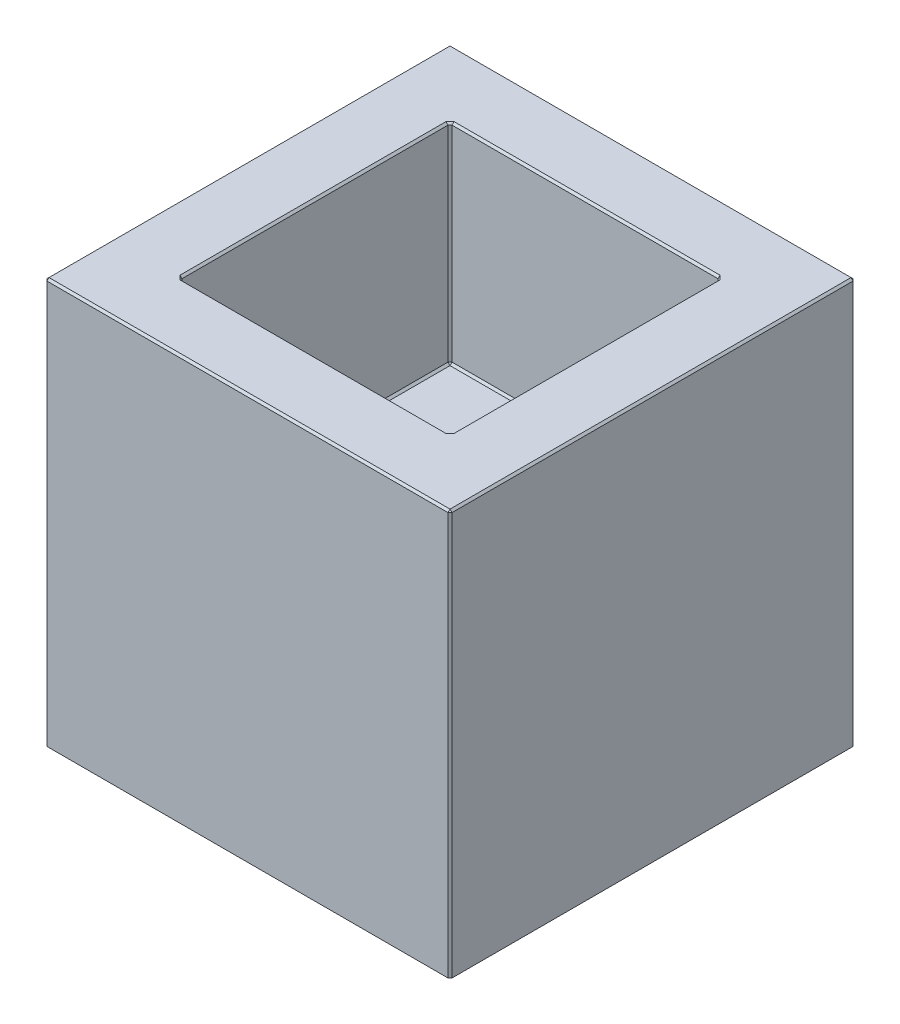
ISO-10303-21;
HEADER;
FILE_DESCRIPTION(('STEP AP214'),'2;1');
FILE_NAME('part.step','',(''),(''),'','','');
FILE_SCHEMA(('AUTOMOTIVE_DESIGN { 1 0 10303 214 1 1 1 1 }'));
ENDSEC;
DATA;
#1=APPLICATION_CONTEXT('core data for automotive mechanical design processes');
#2=APPLICATION_PROTOCOL_DEFINITION('international standard','automotive_design',2000,#1);
#3=PRODUCT_CONTEXT('',#1,'mechanical');
#4=PRODUCT('Part','Part','',(#3));
#5=PRODUCT_RELATED_PRODUCT_CATEGORY('part','',(#4));
#6=PRODUCT_DEFINITION_FORMATION('','',#4);
#7=PRODUCT_DEFINITION_CONTEXT('part definition',#1,'design');
#8=PRODUCT_DEFINITION('design','',#6,#7);
#9=PRODUCT_DEFINITION_SHAPE('','',#8);
#10=(LENGTH_UNIT() NAMED_UNIT(*) SI_UNIT(.MILLI.,.METRE.));
#11=(NAMED_UNIT(*) PLANE_ANGLE_UNIT() SI_UNIT($,.RADIAN.));
#12=(NAMED_UNIT(*) SI_UNIT($,.STERADIAN.) SOLID_ANGLE_UNIT());
#13=UNCERTAINTY_MEASURE_WITH_UNIT(LENGTH_MEASURE(1.E-05),#10,'distance_accuracy_value','');
#14=(GEOMETRIC_REPRESENTATION_CONTEXT(3) GLOBAL_UNCERTAINTY_ASSIGNED_CONTEXT((#13)) GLOBAL_UNIT_ASSIGNED_CONTEXT((#10,
#11,#12)) REPRESENTATION_CONTEXT('',''));
#15=CARTESIAN_POINT('',(0.,0.,0.));
#16=DIRECTION('',(0.,0.,1.));
#17=DIRECTION('',(1.,0.,0.));
#18=AXIS2_PLACEMENT_3D('',#15,#16,#17);
#19=CARTESIAN_POINT('',(0.,6.,0.));
#20=DIRECTION('',(0.,-1.,0.));
#21=DIRECTION('',(0.,0.,-1.));
#22=AXIS2_PLACEMENT_3D('',#19,#20,#21);
#23=PLANE('',#22);
#24=DIRECTION('',(0.,0.,1.));
#25=VECTOR('',#24,1.);
#26=CARTESIAN_POINT('',(-2.97,6.,0.));
#27=LINE('',#26,#25);
#28=CARTESIAN_POINT('',(-2.97,6.,-2.97));
#29=VERTEX_POINT('',#28);
#30=CARTESIAN_POINT('',(-2.97,6.,2.97));
#31=VERTEX_POINT('',#30);
#32=EDGE_CURVE('E244',#29,#31,#27,.T.);
#33=ORIENTED_EDGE('',*,*,#32,.T.);
#34=DIRECTION('',(1.,0.,0.));
#35=VECTOR('',#34,1.);
#36=CARTESIAN_POINT('',(0.,6.,2.97));
#37=LINE('',#36,#35);
#38=CARTESIAN_POINT('',(2.97,6.,2.97));
#39=VERTEX_POINT('',#38);
#40=EDGE_CURVE('E246',#31,#39,#37,.T.);
#41=ORIENTED_EDGE('',*,*,#40,.T.);
#42=DIRECTION('',(0.,0.,-1.));
#43=VECTOR('',#42,1.);
#44=CARTESIAN_POINT('',(2.97,6.,0.));
#45=LINE('',#44,#43);
#46=CARTESIAN_POINT('',(2.97,6.,-2.97));
#47=VERTEX_POINT('',#46);
#48=EDGE_CURVE('E240',#39,#47,#45,.T.);
#49=ORIENTED_EDGE('',*,*,#48,.T.);
#50=DIRECTION('',(-1.,0.,0.));
#51=VECTOR('',#50,1.);
#52=CARTESIAN_POINT('',(0.,6.,-2.97));
#53=LINE('',#52,#51);
#54=EDGE_CURVE('E242',#47,#29,#53,.T.);
#55=ORIENTED_EDGE('',*,*,#54,.T.);
#56=EDGE_LOOP('',(#33,#41,#49,#55));
#57=FACE_BOUND('',#56,.T.);
#58=DIRECTION('',(0.707106781186548,0.,0.707106781186548));
#59=VECTOR('',#58,1.);
#60=CARTESIAN_POINT('',(-1.97,6.,2.03));
#61=LINE('',#60,#59);
#62=CARTESIAN_POINT('',(-2.03,6.,1.97));
#63=VERTEX_POINT('',#62);
#64=CARTESIAN_POINT('',(-2.,6.,2.));
#65=VERTEX_POINT('',#64);
#66=EDGE_CURVE('E221',#63,#65,#61,.T.);
#67=ORIENTED_EDGE('',*,*,#66,.F.);
#68=DIRECTION('',(0.,0.,-1.));
#69=VECTOR('',#68,1.);
#70=CARTESIAN_POINT('',(-2.03,6.,0.));
#71=LINE('',#70,#69);
#72=CARTESIAN_POINT('',(-2.03,6.,-1.97));
#73=VERTEX_POINT('',#72);
#74=EDGE_CURVE('E217',#63,#73,#71,.T.);
#75=ORIENTED_EDGE('',*,*,#74,.T.);
#76=DIRECTION('',(-0.707106781186532,0.,0.707106781186563));
#77=VECTOR('',#76,1.);
#78=CARTESIAN_POINT('',(-2.03,6.,-1.97));
#79=LINE('',#78,#77);
#80=CARTESIAN_POINT('',(-2.,6.,-2.));
#81=VERTEX_POINT('',#80);
#82=EDGE_CURVE('E212',#81,#73,#79,.T.);
#83=ORIENTED_EDGE('',*,*,#82,.F.);
#84=DIRECTION('',(-0.707106781186532,0.,0.707106781186563));
#85=VECTOR('',#84,1.);
#86=CARTESIAN_POINT('',(-2.03,6.,-1.97));
#87=LINE('',#86,#85);
#88=CARTESIAN_POINT('',(-1.97,6.,-2.03));
#89=VERTEX_POINT('',#88);
#90=EDGE_CURVE('E214',#89,#81,#87,.T.);
#91=ORIENTED_EDGE('',*,*,#90,.F.);
#92=DIRECTION('',(1.,0.,0.));
#93=VECTOR('',#92,1.);
#94=CARTESIAN_POINT('',(0.,6.,-2.03));
#95=LINE('',#94,#93);
#96=CARTESIAN_POINT('',(1.97,6.,-2.03));
#97=VERTEX_POINT('',#96);
#98=EDGE_CURVE('E229',#89,#97,#95,.T.);
#99=ORIENTED_EDGE('',*,*,#98,.T.);
#100=DIRECTION('',(-0.707106781186548,0.,-0.707106781186548));
#101=VECTOR('',#100,1.);
#102=CARTESIAN_POINT('',(1.97,6.,-2.03));
#103=LINE('',#102,#101);
#104=CARTESIAN_POINT('',(2.,6.,-2.));
#105=VERTEX_POINT('',#104);
#106=EDGE_CURVE('E233',#105,#97,#103,.T.);
#107=ORIENTED_EDGE('',*,*,#106,.F.);
#108=DIRECTION('',(-0.707106781186548,0.,-0.707106781186548));
#109=VECTOR('',#108,1.);
#110=CARTESIAN_POINT('',(1.97,6.,-2.03));
#111=LINE('',#110,#109);
#112=CARTESIAN_POINT('',(2.03,6.,-1.97));
#113=VERTEX_POINT('',#112);
#114=EDGE_CURVE('E436',#113,#105,#111,.T.);
#115=ORIENTED_EDGE('',*,*,#114,.F.);
#116=DIRECTION('',(0.,0.,1.));
#117=VECTOR('',#116,1.);
#118=CARTESIAN_POINT('',(2.03,6.,0.));
#119=LINE('',#118,#117);
#120=CARTESIAN_POINT('',(2.03,6.,1.97));
#121=VERTEX_POINT('',#120);
#122=EDGE_CURVE('E442',#113,#121,#119,.T.);
#123=ORIENTED_EDGE('',*,*,#122,.T.);
#124=DIRECTION('',(0.707106781186563,0.,-0.707106781186532));
#125=VECTOR('',#124,1.);
#126=CARTESIAN_POINT('',(2.03,6.,1.97));
#127=LINE('',#126,#125);
#128=CARTESIAN_POINT('',(2.,6.,2.));
#129=VERTEX_POINT('',#128);
#130=EDGE_CURVE('E451',#129,#121,#127,.T.);
#131=ORIENTED_EDGE('',*,*,#130,.F.);
#132=DIRECTION('',(0.707106781186563,0.,-0.707106781186532));
#133=VECTOR('',#132,1.);
#134=CARTESIAN_POINT('',(2.03,6.,1.97));
#135=LINE('',#134,#133);
#136=CARTESIAN_POINT('',(1.97,6.,2.03));
#137=VERTEX_POINT('',#136);
#138=EDGE_CURVE('E446',#137,#129,#135,.T.);
#139=ORIENTED_EDGE('',*,*,#138,.F.);
#140=DIRECTION('',(-1.,0.,0.));
#141=VECTOR('',#140,1.);
#142=CARTESIAN_POINT('',(0.,6.,2.03));
#143=LINE('',#142,#141);
#144=CARTESIAN_POINT('',(-1.97,6.,2.03));
#145=VERTEX_POINT('',#144);
#146=EDGE_CURVE('E439',#137,#145,#143,.T.);
#147=ORIENTED_EDGE('',*,*,#146,.T.);
#148=DIRECTION('',(0.707106781186548,0.,0.707106781186548));
#149=VECTOR('',#148,1.);
#150=CARTESIAN_POINT('',(-1.97,6.,2.03));
#151=LINE('',#150,#149);
#152=EDGE_CURVE('E228',#65,#145,#151,.T.);
#153=ORIENTED_EDGE('',*,*,#152,.F.);
#154=EDGE_LOOP('',(#67,#75,#83,#91,#99,#107,#115,#123,#131,#139,#147,#153));
#155=FACE_BOUND('',#154,.T.);
#156=ADVANCED_FACE('F39',(#57,#155),#23,.F.);
#157=CARTESIAN_POINT('',(3.,6.,3.));
#158=DIRECTION('',(-1.,0.,0.));
#159=DIRECTION('',(0.,0.,1.));
#160=AXIS2_PLACEMENT_3D('',#157,#158,#159);
#161=PLANE('',#160);
#162=DIRECTION('',(0.,0.,-1.));
#163=VECTOR('',#162,1.);
#164=CARTESIAN_POINT('',(3.,0.,3.));
#165=LINE('',#164,#163);
#166=CARTESIAN_POINT('',(3.,0.,2.97));
#167=VERTEX_POINT('',#166);
#168=CARTESIAN_POINT('',(3.,0.,-2.97));
#169=VERTEX_POINT('',#168);
#170=EDGE_CURVE('E325',#167,#169,#165,.T.);
#171=ORIENTED_EDGE('',*,*,#170,.T.);
#172=DIRECTION('',(0.,1.,0.));
#173=VECTOR('',#172,1.);
#174=CARTESIAN_POINT('',(3.,6.,-2.97));
#175=LINE('',#174,#173);
#176=CARTESIAN_POINT('',(3.,5.97,-2.97));
#177=VERTEX_POINT('',#176);
#178=EDGE_CURVE('E466',#169,#177,#175,.T.);
#179=ORIENTED_EDGE('',*,*,#178,.T.);
#180=DIRECTION('',(0.,0.,1.));
#181=VECTOR('',#180,1.);
#182=CARTESIAN_POINT('',(3.,5.97,3.));
#183=LINE('',#182,#181);
#184=CARTESIAN_POINT('',(3.,5.97,2.97));
#185=VERTEX_POINT('',#184);
#186=EDGE_CURVE('E470',#177,#185,#183,.T.);
#187=ORIENTED_EDGE('',*,*,#186,.T.);
#188=DIRECTION('',(0.,-1.,0.));
#189=VECTOR('',#188,1.);
#190=CARTESIAN_POINT('',(3.,6.,2.97));
#191=LINE('',#190,#189);
#192=EDGE_CURVE('E468',#185,#167,#191,.T.);
#193=ORIENTED_EDGE('',*,*,#192,.T.);
#194=EDGE_LOOP('',(#171,#179,#187,#193));
#195=FACE_BOUND('',#194,.T.);
#196=ADVANCED_FACE('F500',(#195),#161,.F.);
#197=CARTESIAN_POINT('',(-3.,6.,-3.));
#198=DIRECTION('',(0.,0.,1.));
#199=DIRECTION('',(1.,0.,0.));
#200=AXIS2_PLACEMENT_3D('',#197,#198,#199);
#201=PLANE('',#200);
#202=DIRECTION('',(1.,0.,0.));
#203=VECTOR('',#202,1.);
#204=CARTESIAN_POINT('',(-3.,5.97,-3.));
#205=LINE('',#204,#203);
#206=CARTESIAN_POINT('',(-2.97,5.97,-3.));
#207=VERTEX_POINT('',#206);
#208=CARTESIAN_POINT('',(2.97,5.97,-3.));
#209=VERTEX_POINT('',#208);
#210=EDGE_CURVE('E485',#207,#209,#205,.T.);
#211=ORIENTED_EDGE('',*,*,#210,.T.);
#212=DIRECTION('',(0.,-1.,0.));
#213=VECTOR('',#212,1.);
#214=CARTESIAN_POINT('',(2.97,6.,-3.));
#215=LINE('',#214,#213);
#216=CARTESIAN_POINT('',(2.97,0.,-3.));
#217=VERTEX_POINT('',#216);
#218=EDGE_CURVE('E480',#209,#217,#215,.T.);
#219=ORIENTED_EDGE('',*,*,#218,.T.);
#220=DIRECTION('',(-1.,0.,0.));
#221=VECTOR('',#220,1.);
#222=CARTESIAN_POINT('',(-3.,0.,-3.));
#223=LINE('',#222,#221);
#224=CARTESIAN_POINT('',(-2.97,0.,-3.));
#225=VERTEX_POINT('',#224);
#226=EDGE_CURVE('E493',#217,#225,#223,.T.);
#227=ORIENTED_EDGE('',*,*,#226,.T.);
#228=DIRECTION('',(0.,1.,0.));
#229=VECTOR('',#228,1.);
#230=CARTESIAN_POINT('',(-2.97,6.,-3.));
#231=LINE('',#230,#229);
#232=EDGE_CURVE('E483',#225,#207,#231,.T.);
#233=ORIENTED_EDGE('',*,*,#232,.T.);
#234=EDGE_LOOP('',(#211,#219,#227,#233));
#235=FACE_BOUND('',#234,.T.);
#236=ADVANCED_FACE('F565',(#235),#201,.F.);
#237=CARTESIAN_POINT('',(-3.,6.,3.));
#238=DIRECTION('',(1.,0.,0.));
#239=DIRECTION('',(0.,0.,-1.));
#240=AXIS2_PLACEMENT_3D('',#237,#238,#239);
#241=PLANE('',#240);
#242=DIRECTION('',(0.,0.,-1.));
#243=VECTOR('',#242,1.);
#244=CARTESIAN_POINT('',(-3.,5.97,3.));
#245=LINE('',#244,#243);
#246=CARTESIAN_POINT('',(-3.,5.97,2.97));
#247=VERTEX_POINT('',#246);
#248=CARTESIAN_POINT('',(-3.,5.97,-2.97));
#249=VERTEX_POINT('',#248);
#250=EDGE_CURVE('E464',#247,#249,#245,.T.);
#251=ORIENTED_EDGE('',*,*,#250,.T.);
#252=DIRECTION('',(0.,-1.,0.));
#253=VECTOR('',#252,1.);
#254=CARTESIAN_POINT('',(-3.,6.,-2.97));
#255=LINE('',#254,#253);
#256=CARTESIAN_POINT('',(-3.,0.,-2.97));
#257=VERTEX_POINT('',#256);
#258=EDGE_CURVE('E460',#249,#257,#255,.T.);
#259=ORIENTED_EDGE('',*,*,#258,.T.);
#260=DIRECTION('',(0.,0.,1.));
#261=VECTOR('',#260,1.);
#262=CARTESIAN_POINT('',(-3.,0.,3.));
#263=LINE('',#262,#261);
#264=CARTESIAN_POINT('',(-3.,0.,2.97));
#265=VERTEX_POINT('',#264);
#266=EDGE_CURVE('E490',#257,#265,#263,.T.);
#267=ORIENTED_EDGE('',*,*,#266,.T.);
#268=DIRECTION('',(0.,1.,0.));
#269=VECTOR('',#268,1.);
#270=CARTESIAN_POINT('',(-3.,6.,2.97));
#271=LINE('',#270,#269);
#272=EDGE_CURVE('E462',#265,#247,#271,.T.);
#273=ORIENTED_EDGE('',*,*,#272,.T.);
#274=EDGE_LOOP('',(#251,#259,#267,#273));
#275=FACE_BOUND('',#274,.T.);
#276=ADVANCED_FACE('F552',(#275),#241,.F.);
#277=CARTESIAN_POINT('',(-3.,6.,3.));
#278=DIRECTION('',(0.,0.,-1.));
#279=DIRECTION('',(-1.,0.,0.));
#280=AXIS2_PLACEMENT_3D('',#277,#278,#279);
#281=PLANE('',#280);
#282=DIRECTION('',(-1.,0.,0.));
#283=VECTOR('',#282,1.);
#284=CARTESIAN_POINT('',(-3.,5.97,3.));
#285=LINE('',#284,#283);
#286=CARTESIAN_POINT('',(2.97,5.97,3.));
#287=VERTEX_POINT('',#286);
#288=CARTESIAN_POINT('',(-2.97,5.97,3.));
#289=VERTEX_POINT('',#288);
#290=EDGE_CURVE('E458',#287,#289,#285,.T.);
#291=ORIENTED_EDGE('',*,*,#290,.T.);
#292=DIRECTION('',(0.,-1.,0.));
#293=VECTOR('',#292,1.);
#294=CARTESIAN_POINT('',(-2.97,6.,3.));
#295=LINE('',#294,#293);
#296=CARTESIAN_POINT('',(-2.97,0.,3.));
#297=VERTEX_POINT('',#296);
#298=EDGE_CURVE('E454',#289,#297,#295,.T.);
#299=ORIENTED_EDGE('',*,*,#298,.T.);
#300=DIRECTION('',(1.,0.,0.));
#301=VECTOR('',#300,1.);
#302=CARTESIAN_POINT('',(-3.,0.,3.));
#303=LINE('',#302,#301);
#304=CARTESIAN_POINT('',(2.97,0.,3.));
#305=VERTEX_POINT('',#304);
#306=EDGE_CURVE('E487',#297,#305,#303,.T.);
#307=ORIENTED_EDGE('',*,*,#306,.T.);
#308=DIRECTION('',(0.,1.,0.));
#309=VECTOR('',#308,1.);
#310=CARTESIAN_POINT('',(2.97,6.,3.));
#311=LINE('',#310,#309);
#312=EDGE_CURVE('E456',#305,#287,#311,.T.);
#313=ORIENTED_EDGE('',*,*,#312,.T.);
#314=EDGE_LOOP('',(#291,#299,#307,#313));
#315=FACE_BOUND('',#314,.T.);
#316=ADVANCED_FACE('F546',(#315),#281,.F.);
#317=CARTESIAN_POINT('',(0.,0.,0.));
#318=DIRECTION('',(0.,-1.,0.));
#319=DIRECTION('',(0.,0.,-1.));
#320=AXIS2_PLACEMENT_3D('',#317,#318,#319);
#321=PLANE('',#320);
#322=ORIENTED_EDGE('',*,*,#226,.F.);
#323=DIRECTION('',(-0.707106781186537,0.,-0.707106781186558));
#324=VECTOR('',#323,1.);
#325=CARTESIAN_POINT('',(2.98500000000004,0.,-2.98499999999996));
#326=LINE('',#325,#324);
#327=EDGE_CURVE('E472',#217,#169,#326,.F.);
#328=ORIENTED_EDGE('',*,*,#327,.T.);
#329=ORIENTED_EDGE('',*,*,#170,.F.);
#330=DIRECTION('',(0.707106781186542,0.,-0.707106781186553));
#331=VECTOR('',#330,1.);
#332=CARTESIAN_POINT('',(2.98500000000002,0.,2.98499999999998));
#333=LINE('',#332,#331);
#334=EDGE_CURVE('E478',#167,#305,#333,.F.);
#335=ORIENTED_EDGE('',*,*,#334,.T.);
#336=ORIENTED_EDGE('',*,*,#306,.F.);
#337=DIRECTION('',(0.707106781186548,0.,0.707106781186548));
#338=VECTOR('',#337,1.);
#339=CARTESIAN_POINT('',(-2.985,0.,2.985));
#340=LINE('',#339,#338);
#341=EDGE_CURVE('E476',#297,#265,#340,.F.);
#342=ORIENTED_EDGE('',*,*,#341,.T.);
#343=ORIENTED_EDGE('',*,*,#266,.F.);
#344=DIRECTION('',(-0.707106781186542,0.,0.707106781186553));
#345=VECTOR('',#344,1.);
#346=CARTESIAN_POINT('',(-2.98500000000002,0.,-2.98499999999998));
#347=LINE('',#346,#345);
#348=EDGE_CURVE('E474',#257,#225,#347,.F.);
#349=ORIENTED_EDGE('',*,*,#348,.T.);
#350=EDGE_LOOP('',(#322,#328,#329,#335,#336,#342,#343,#349));
#351=FACE_BOUND('',#350,.T.);
#352=ADVANCED_FACE('F548',(#351),#321,.T.);
#353=CARTESIAN_POINT('',(2.,2.9,2.));
#354=DIRECTION('',(1.,0.,0.));
#355=DIRECTION('',(0.,0.,-1.));
#356=AXIS2_PLACEMENT_3D('',#353,#354,#355);
#357=PLANE('',#356);
#358=DIRECTION('',(0.,0.,1.));
#359=VECTOR('',#358,1.);
#360=CARTESIAN_POINT('',(2.,2.93,2.));
#361=LINE('',#360,#359);
#362=CARTESIAN_POINT('',(2.,2.93,-1.97));
#363=VERTEX_POINT('',#362);
#364=CARTESIAN_POINT('',(2.,2.93,1.97));
#365=VERTEX_POINT('',#364);
#366=EDGE_CURVE('E253',#363,#365,#361,.T.);
#367=ORIENTED_EDGE('',*,*,#366,.T.);
#368=DIRECTION('',(0.,1.,0.));
#369=VECTOR('',#368,1.);
#370=CARTESIAN_POINT('',(2.,6.,1.97));
#371=LINE('',#370,#369);
#372=CARTESIAN_POINT('',(2.,5.97,1.97));
#373=VERTEX_POINT('',#372);
#374=EDGE_CURVE('E255',#365,#373,#371,.T.);
#375=ORIENTED_EDGE('',*,*,#374,.T.);
#376=DIRECTION('',(0.,0.,-1.));
#377=VECTOR('',#376,1.);
#378=CARTESIAN_POINT('',(2.,5.97,2.));
#379=LINE('',#378,#377);
#380=CARTESIAN_POINT('',(2.,5.97,-1.97));
#381=VERTEX_POINT('',#380);
#382=EDGE_CURVE('E249',#373,#381,#379,.T.);
#383=ORIENTED_EDGE('',*,*,#382,.T.);
#384=DIRECTION('',(0.,-1.,0.));
#385=VECTOR('',#384,1.);
#386=CARTESIAN_POINT('',(2.,2.9,-1.97));
#387=LINE('',#386,#385);
#388=EDGE_CURVE('E251',#381,#363,#387,.T.);
#389=ORIENTED_EDGE('',*,*,#388,.T.);
#390=EDGE_LOOP('',(#367,#375,#383,#389));
#391=FACE_BOUND('',#390,.T.);
#392=ADVANCED_FACE('F420',(#391),#357,.F.);
#393=CARTESIAN_POINT('',(-2.,2.9,2.));
#394=DIRECTION('',(0.,0.,1.));
#395=DIRECTION('',(1.,0.,0.));
#396=AXIS2_PLACEMENT_3D('',#393,#394,#395);
#397=PLANE('',#396);
#398=DIRECTION('',(0.,-1.,0.));
#399=VECTOR('',#398,1.);
#400=CARTESIAN_POINT('',(1.97,2.9,2.));
#401=LINE('',#400,#399);
#402=CARTESIAN_POINT('',(1.97,5.97,2.));
#403=VERTEX_POINT('',#402);
#404=CARTESIAN_POINT('',(1.97,2.93,2.));
#405=VERTEX_POINT('',#404);
#406=EDGE_CURVE('E262',#403,#405,#401,.T.);
#407=ORIENTED_EDGE('',*,*,#406,.T.);
#408=DIRECTION('',(-1.,0.,0.));
#409=VECTOR('',#408,1.);
#410=CARTESIAN_POINT('',(-2.,2.93,2.));
#411=LINE('',#410,#409);
#412=CARTESIAN_POINT('',(-1.97,2.93,2.));
#413=VERTEX_POINT('',#412);
#414=EDGE_CURVE('E265',#405,#413,#411,.T.);
#415=ORIENTED_EDGE('',*,*,#414,.T.);
#416=DIRECTION('',(0.,1.,0.));
#417=VECTOR('',#416,1.);
#418=CARTESIAN_POINT('',(-1.97,6.,2.));
#419=LINE('',#418,#417);
#420=CARTESIAN_POINT('',(-1.97,5.97,2.));
#421=VERTEX_POINT('',#420);
#422=EDGE_CURVE('E260',#413,#421,#419,.T.);
#423=ORIENTED_EDGE('',*,*,#422,.T.);
#424=DIRECTION('',(1.,0.,0.));
#425=VECTOR('',#424,1.);
#426=CARTESIAN_POINT('',(-2.,5.97,2.));
#427=LINE('',#426,#425);
#428=EDGE_CURVE('E258',#421,#403,#427,.T.);
#429=ORIENTED_EDGE('',*,*,#428,.T.);
#430=EDGE_LOOP('',(#407,#415,#423,#429));
#431=FACE_BOUND('',#430,.T.);
#432=ADVANCED_FACE('F598',(#431),#397,.F.);
#433=CARTESIAN_POINT('',(-2.,2.9,2.));
#434=DIRECTION('',(-1.,0.,0.));
#435=DIRECTION('',(0.,0.,1.));
#436=AXIS2_PLACEMENT_3D('',#433,#434,#435);
#437=PLANE('',#436);
#438=DIRECTION('',(0.,-1.,0.));
#439=VECTOR('',#438,1.);
#440=CARTESIAN_POINT('',(-2.,2.9,1.97));
#441=LINE('',#440,#439);
#442=CARTESIAN_POINT('',(-2.,5.97,1.97));
#443=VERTEX_POINT('',#442);
#444=CARTESIAN_POINT('',(-2.,2.93,1.97));
#445=VERTEX_POINT('',#444);
#446=EDGE_CURVE('E271',#443,#445,#441,.T.);
#447=ORIENTED_EDGE('',*,*,#446,.T.);
#448=DIRECTION('',(0.,0.,-1.));
#449=VECTOR('',#448,1.);
#450=CARTESIAN_POINT('',(-2.,2.93,-2.));
#451=LINE('',#450,#449);
#452=CARTESIAN_POINT('',(-2.,2.93,-1.97));
#453=VERTEX_POINT('',#452);
#454=EDGE_CURVE('E274',#445,#453,#451,.T.);
#455=ORIENTED_EDGE('',*,*,#454,.T.);
#456=DIRECTION('',(0.,1.,0.));
#457=VECTOR('',#456,1.);
#458=CARTESIAN_POINT('',(-2.,6.,-1.97));
#459=LINE('',#458,#457);
#460=CARTESIAN_POINT('',(-2.,5.97,-1.97));
#461=VERTEX_POINT('',#460);
#462=EDGE_CURVE('E269',#453,#461,#459,.T.);
#463=ORIENTED_EDGE('',*,*,#462,.T.);
#464=DIRECTION('',(0.,0.,1.));
#465=VECTOR('',#464,1.);
#466=CARTESIAN_POINT('',(-2.,5.97,2.));
#467=LINE('',#466,#465);
#468=EDGE_CURVE('E267',#461,#443,#467,.T.);
#469=ORIENTED_EDGE('',*,*,#468,.T.);
#470=EDGE_LOOP('',(#447,#455,#463,#469));
#471=FACE_BOUND('',#470,.T.);
#472=ADVANCED_FACE('F604',(#471),#437,.F.);
#473=CARTESIAN_POINT('',(-2.,2.9,-2.));
#474=DIRECTION('',(0.,0.,-1.));
#475=DIRECTION('',(-1.,0.,0.));
#476=AXIS2_PLACEMENT_3D('',#473,#474,#475);
#477=PLANE('',#476);
#478=DIRECTION('',(-1.,0.,0.));
#479=VECTOR('',#478,1.);
#480=CARTESIAN_POINT('',(-2.,5.97,-2.));
#481=LINE('',#480,#479);
#482=CARTESIAN_POINT('',(1.97,5.97,-2.));
#483=VERTEX_POINT('',#482);
#484=CARTESIAN_POINT('',(-1.97,5.97,-2.));
#485=VERTEX_POINT('',#484);
#486=EDGE_CURVE('E276',#483,#485,#481,.T.);
#487=ORIENTED_EDGE('',*,*,#486,.T.);
#488=DIRECTION('',(0.,-1.,0.));
#489=VECTOR('',#488,1.);
#490=CARTESIAN_POINT('',(-1.97,2.9,-2.));
#491=LINE('',#490,#489);
#492=CARTESIAN_POINT('',(-1.97,2.93,-2.));
#493=VERTEX_POINT('',#492);
#494=EDGE_CURVE('E282',#485,#493,#491,.T.);
#495=ORIENTED_EDGE('',*,*,#494,.T.);
#496=DIRECTION('',(1.,0.,0.));
#497=VECTOR('',#496,1.);
#498=CARTESIAN_POINT('',(2.,2.93,-2.));
#499=LINE('',#498,#497);
#500=CARTESIAN_POINT('',(1.97,2.93,-2.));
#501=VERTEX_POINT('',#500);
#502=EDGE_CURVE('E280',#493,#501,#499,.T.);
#503=ORIENTED_EDGE('',*,*,#502,.T.);
#504=DIRECTION('',(0.,1.,0.));
#505=VECTOR('',#504,1.);
#506=CARTESIAN_POINT('',(1.97,6.,-2.));
#507=LINE('',#506,#505);
#508=EDGE_CURVE('E278',#501,#483,#507,.T.);
#509=ORIENTED_EDGE('',*,*,#508,.T.);
#510=EDGE_LOOP('',(#487,#495,#503,#509));
#511=FACE_BOUND('',#510,.T.);
#512=ADVANCED_FACE('F430',(#511),#477,.F.);
#513=CARTESIAN_POINT('',(0.,2.9,0.));
#514=DIRECTION('',(0.,-1.,0.));
#515=DIRECTION('',(0.,0.,-1.));
#516=AXIS2_PLACEMENT_3D('',#513,#514,#515);
#517=PLANE('',#516);
#518=DIRECTION('',(0.,0.,1.));
#519=VECTOR('',#518,1.);
#520=CARTESIAN_POINT('',(-1.97,2.9,2.));
#521=LINE('',#520,#519);
#522=CARTESIAN_POINT('',(-1.97,2.9,-1.97));
#523=VERTEX_POINT('',#522);
#524=CARTESIAN_POINT('',(-1.97,2.9,1.97));
#525=VERTEX_POINT('',#524);
#526=EDGE_CURVE('E49',#523,#525,#521,.T.);
#527=ORIENTED_EDGE('',*,*,#526,.T.);
#528=DIRECTION('',(1.,0.,0.));
#529=VECTOR('',#528,1.);
#530=CARTESIAN_POINT('',(2.,2.9,1.97));
#531=LINE('',#530,#529);
#532=CARTESIAN_POINT('',(1.97,2.9,1.97));
#533=VERTEX_POINT('',#532);
#534=EDGE_CURVE('E11',#525,#533,#531,.T.);
#535=ORIENTED_EDGE('',*,*,#534,.T.);
#536=DIRECTION('',(0.,0.,-1.));
#537=VECTOR('',#536,1.);
#538=CARTESIAN_POINT('',(1.97,2.9,-2.));
#539=LINE('',#538,#537);
#540=CARTESIAN_POINT('',(1.97,2.9,-1.97));
#541=VERTEX_POINT('',#540);
#542=EDGE_CURVE('E285',#533,#541,#539,.T.);
#543=ORIENTED_EDGE('',*,*,#542,.T.);
#544=DIRECTION('',(-1.,0.,0.));
#545=VECTOR('',#544,1.);
#546=CARTESIAN_POINT('',(-2.,2.9,-1.97));
#547=LINE('',#546,#545);
#548=EDGE_CURVE('E60',#541,#523,#547,.T.);
#549=ORIENTED_EDGE('',*,*,#548,.T.);
#550=EDGE_LOOP('',(#527,#535,#543,#549));
#551=FACE_BOUND('',#550,.T.);
#552=ADVANCED_FACE('F406',(#551),#517,.F.);
#553=CARTESIAN_POINT('',(-2.97,6.,3.));
#554=DIRECTION('',(0.707106781186548,0.,-0.707106781186548));
#555=DIRECTION('',(0.,-1.,0.));
#556=AXIS2_PLACEMENT_3D('',#553,#554,#555);
#557=PLANE('',#556);
#558=DIRECTION('',(-0.707106781186548,0.,-0.707106781186548));
#559=VECTOR('',#558,1.);
#560=CARTESIAN_POINT('',(-3.,5.97,2.97));
#561=LINE('',#560,#559);
#562=EDGE_CURVE('E322',#247,#289,#561,.F.);
#563=ORIENTED_EDGE('',*,*,#562,.F.);
#564=ORIENTED_EDGE('',*,*,#272,.F.);
#565=ORIENTED_EDGE('',*,*,#341,.F.);
#566=ORIENTED_EDGE('',*,*,#298,.F.);
#567=EDGE_LOOP('',(#563,#564,#565,#566));
#568=FACE_BOUND('',#567,.T.);
#569=ADVANCED_FACE('F542',(#568),#557,.F.);
#570=CARTESIAN_POINT('',(-3.,5.97,2.97));
#571=DIRECTION('',(-0.577350269189626,0.577350269189626,0.577350269189626));
#572=DIRECTION('',(0.707106781186547,0.,0.707106781186547));
#573=AXIS2_PLACEMENT_3D('',#570,#571,#572);
#574=PLANE('',#573);
#575=DIRECTION('',(0.707106781186548,0.707106781186548,0.));
#576=VECTOR('',#575,1.);
#577=CARTESIAN_POINT('',(-3.,5.97,2.97));
#578=LINE('',#577,#576);
#579=EDGE_CURVE('E316',#247,#31,#578,.T.);
#580=ORIENTED_EDGE('',*,*,#579,.F.);
#581=ORIENTED_EDGE('',*,*,#562,.T.);
#582=DIRECTION('',(0.,-0.707106781186548,0.707106781186548));
#583=VECTOR('',#582,1.);
#584=CARTESIAN_POINT('',(-2.97,5.985,2.985));
#585=LINE('',#584,#583);
#586=EDGE_CURVE('E319',#31,#289,#585,.T.);
#587=ORIENTED_EDGE('',*,*,#586,.F.);
#588=EDGE_LOOP('',(#580,#581,#587));
#589=FACE_BOUND('',#588,.T.);
#590=ADVANCED_FACE('F537',(#589),#574,.T.);
#591=CARTESIAN_POINT('',(3.,6.,2.97));
#592=DIRECTION('',(-0.707106781186553,0.,-0.707106781186542));
#593=DIRECTION('',(0.,-1.,0.));
#594=AXIS2_PLACEMENT_3D('',#591,#592,#593);
#595=PLANE('',#594);
#596=ORIENTED_EDGE('',*,*,#334,.F.);
#597=ORIENTED_EDGE('',*,*,#192,.F.);
#598=DIRECTION('',(-0.707106781186542,0.,0.707106781186552));
#599=VECTOR('',#598,1.);
#600=CARTESIAN_POINT('',(2.97,5.97,3.));
#601=LINE('',#600,#599);
#602=EDGE_CURVE('E313',#287,#185,#601,.F.);
#603=ORIENTED_EDGE('',*,*,#602,.F.);
#604=ORIENTED_EDGE('',*,*,#312,.F.);
#605=EDGE_LOOP('',(#596,#597,#603,#604));
#606=FACE_BOUND('',#605,.T.);
#607=ADVANCED_FACE('F518',(#606),#595,.F.);
#608=CARTESIAN_POINT('',(0.,6.,2.97));
#609=DIRECTION('',(0.,-0.707106781186548,-0.707106781186548));
#610=DIRECTION('',(1.,0.,0.));
#611=AXIS2_PLACEMENT_3D('',#608,#609,#610);
#612=PLANE('',#611);
#613=ORIENTED_EDGE('',*,*,#586,.T.);
#614=ORIENTED_EDGE('',*,*,#290,.F.);
#615=DIRECTION('',(0.,0.707106781186547,-0.707106781186547));
#616=VECTOR('',#615,1.);
#617=CARTESIAN_POINT('',(2.97,5.97,3.));
#618=LINE('',#617,#616);
#619=EDGE_CURVE('E310',#39,#287,#618,.F.);
#620=ORIENTED_EDGE('',*,*,#619,.F.);
#621=ORIENTED_EDGE('',*,*,#40,.F.);
#622=EDGE_LOOP('',(#613,#614,#620,#621));
#623=FACE_BOUND('',#622,.T.);
#624=ADVANCED_FACE('F526',(#623),#612,.F.);
#625=CARTESIAN_POINT('',(-2.97,6.,0.));
#626=DIRECTION('',(0.707106781186548,-0.707106781186548,0.));
#627=DIRECTION('',(0.,0.,1.));
#628=AXIS2_PLACEMENT_3D('',#625,#626,#627);
#629=PLANE('',#628);
#630=ORIENTED_EDGE('',*,*,#579,.T.);
#631=ORIENTED_EDGE('',*,*,#32,.F.);
#632=DIRECTION('',(-0.707106781186548,-0.707106781186548,0.));
#633=VECTOR('',#632,1.);
#634=CARTESIAN_POINT('',(-2.985,5.985,-2.97));
#635=LINE('',#634,#633);
#636=EDGE_CURVE('E307',#249,#29,#635,.F.);
#637=ORIENTED_EDGE('',*,*,#636,.F.);
#638=ORIENTED_EDGE('',*,*,#250,.F.);
#639=EDGE_LOOP('',(#630,#631,#637,#638));
#640=FACE_BOUND('',#639,.T.);
#641=ADVANCED_FACE('F535',(#640),#629,.F.);
#642=CARTESIAN_POINT('',(-3.,6.,-2.97));
#643=DIRECTION('',(0.707106781186553,0.,0.707106781186542));
#644=DIRECTION('',(0.,-1.,0.));
#645=AXIS2_PLACEMENT_3D('',#642,#643,#644);
#646=PLANE('',#645);
#647=ORIENTED_EDGE('',*,*,#348,.F.);
#648=ORIENTED_EDGE('',*,*,#258,.F.);
#649=DIRECTION('',(0.707106781186542,0.,-0.707106781186553));
#650=VECTOR('',#649,1.);
#651=CARTESIAN_POINT('',(-2.97,5.97,-3.));
#652=LINE('',#651,#650);
#653=EDGE_CURVE('E304',#207,#249,#652,.F.);
#654=ORIENTED_EDGE('',*,*,#653,.F.);
#655=ORIENTED_EDGE('',*,*,#232,.F.);
#656=EDGE_LOOP('',(#647,#648,#654,#655));
#657=FACE_BOUND('',#656,.T.);
#658=ADVANCED_FACE('F556',(#657),#646,.F.);
#659=CARTESIAN_POINT('',(2.97,5.97,3.));
#660=DIRECTION('',(0.577350269189629,0.577350269189629,0.57735026918962));
#661=DIRECTION('',(-0.707106781186547,0.707106781186547,0.));
#662=AXIS2_PLACEMENT_3D('',#659,#660,#661);
#663=PLANE('',#662);
#664=ORIENTED_EDGE('',*,*,#619,.T.);
#665=ORIENTED_EDGE('',*,*,#602,.T.);
#666=DIRECTION('',(0.707106781186548,-0.707106781186548,0.));
#667=VECTOR('',#666,1.);
#668=CARTESIAN_POINT('',(2.985,5.985,2.97));
#669=LINE('',#668,#667);
#670=EDGE_CURVE('E301',#39,#185,#669,.T.);
#671=ORIENTED_EDGE('',*,*,#670,.F.);
#672=EDGE_LOOP('',(#664,#665,#671));
#673=FACE_BOUND('',#672,.T.);
#674=ADVANCED_FACE('F521',(#673),#663,.T.);
#675=CARTESIAN_POINT('',(-2.97,5.97,-3.));
#676=DIRECTION('',(-0.577350269189631,0.577350269189623,-0.577350269189623));
#677=DIRECTION('',(-0.707106781186542,0.,0.707106781186553));
#678=AXIS2_PLACEMENT_3D('',#675,#676,#677);
#679=PLANE('',#678);
#680=ORIENTED_EDGE('',*,*,#653,.T.);
#681=ORIENTED_EDGE('',*,*,#636,.T.);
#682=DIRECTION('',(0.,0.707106781186548,0.707106781186548));
#683=VECTOR('',#682,1.);
#684=CARTESIAN_POINT('',(-2.97,5.97,-3.));
#685=LINE('',#684,#683);
#686=EDGE_CURVE('E298',#207,#29,#685,.T.);
#687=ORIENTED_EDGE('',*,*,#686,.F.);
#688=EDGE_LOOP('',(#680,#681,#687));
#689=FACE_BOUND('',#688,.T.);
#690=ADVANCED_FACE('F560',(#689),#679,.T.);
#691=CARTESIAN_POINT('',(2.97,6.,0.));
#692=DIRECTION('',(-0.707106781186548,-0.707106781186548,0.));
#693=DIRECTION('',(0.,0.,-1.));
#694=AXIS2_PLACEMENT_3D('',#691,#692,#693);
#695=PLANE('',#694);
#696=ORIENTED_EDGE('',*,*,#670,.T.);
#697=ORIENTED_EDGE('',*,*,#186,.F.);
#698=DIRECTION('',(-0.707106781186548,0.707106781186548,0.));
#699=VECTOR('',#698,1.);
#700=CARTESIAN_POINT('',(3.,5.97,-2.97));
#701=LINE('',#700,#699);
#702=EDGE_CURVE('E295',#47,#177,#701,.F.);
#703=ORIENTED_EDGE('',*,*,#702,.F.);
#704=ORIENTED_EDGE('',*,*,#48,.F.);
#705=EDGE_LOOP('',(#696,#697,#703,#704));
#706=FACE_BOUND('',#705,.T.);
#707=ADVANCED_FACE('F514',(#706),#695,.F.);
#708=CARTESIAN_POINT('',(0.,6.,-2.97));
#709=DIRECTION('',(0.,-0.707106781186548,0.707106781186548));
#710=DIRECTION('',(-1.,0.,0.));
#711=AXIS2_PLACEMENT_3D('',#708,#709,#710);
#712=PLANE('',#711);
#713=ORIENTED_EDGE('',*,*,#686,.T.);
#714=ORIENTED_EDGE('',*,*,#54,.F.);
#715=DIRECTION('',(0.,-0.707106781186548,-0.707106781186548));
#716=VECTOR('',#715,1.);
#717=CARTESIAN_POINT('',(2.97,5.985,-2.985));
#718=LINE('',#717,#716);
#719=EDGE_CURVE('E292',#209,#47,#718,.F.);
#720=ORIENTED_EDGE('',*,*,#719,.F.);
#721=ORIENTED_EDGE('',*,*,#210,.F.);
#722=EDGE_LOOP('',(#713,#714,#720,#721));
#723=FACE_BOUND('',#722,.T.);
#724=ADVANCED_FACE('F563',(#723),#712,.F.);
#725=CARTESIAN_POINT('',(3.,5.97,-2.97));
#726=DIRECTION('',(0.577350269189634,0.577350269189626,-0.577350269189617));
#727=DIRECTION('',(-0.707106781186542,0.707106781186553,0.));
#728=AXIS2_PLACEMENT_3D('',#725,#726,#727);
#729=PLANE('',#728);
#730=ORIENTED_EDGE('',*,*,#719,.T.);
#731=ORIENTED_EDGE('',*,*,#702,.T.);
#732=DIRECTION('',(0.707106781186537,0.,0.707106781186558));
#733=VECTOR('',#732,1.);
#734=CARTESIAN_POINT('',(3.,5.97,-2.97));
#735=LINE('',#734,#733);
#736=EDGE_CURVE('E289',#209,#177,#735,.T.);
#737=ORIENTED_EDGE('',*,*,#736,.F.);
#738=EDGE_LOOP('',(#730,#731,#737));
#739=FACE_BOUND('',#738,.T.);
#740=ADVANCED_FACE('F510',(#739),#729,.T.);
#741=CARTESIAN_POINT('',(2.97,6.,-3.));
#742=DIRECTION('',(-0.707106781186558,0.,0.707106781186537));
#743=DIRECTION('',(0.,-1.,0.));
#744=AXIS2_PLACEMENT_3D('',#741,#742,#743);
#745=PLANE('',#744);
#746=ORIENTED_EDGE('',*,*,#736,.T.);
#747=ORIENTED_EDGE('',*,*,#178,.F.);
#748=ORIENTED_EDGE('',*,*,#327,.F.);
#749=ORIENTED_EDGE('',*,*,#218,.F.);
#750=EDGE_LOOP('',(#746,#747,#748,#749));
#751=FACE_BOUND('',#750,.T.);
#752=ADVANCED_FACE('F506',(#751),#745,.F.);
#753=CARTESIAN_POINT('',(-2.,2.9,-1.97));
#754=DIRECTION('',(0.707106781186563,0.,0.707106781186532));
#755=DIRECTION('',(0.,-1.,0.));
#756=AXIS2_PLACEMENT_3D('',#753,#754,#755);
#757=PLANE('',#756);
#758=DIRECTION('',(0.707106781186532,0.,-0.707106781186563));
#759=VECTOR('',#758,1.);
#760=CARTESIAN_POINT('',(-1.97,2.93,-2.));
#761=LINE('',#760,#759);
#762=EDGE_CURVE('E44',#493,#453,#761,.F.);
#763=ORIENTED_EDGE('',*,*,#762,.F.);
#764=ORIENTED_EDGE('',*,*,#494,.F.);
#765=DIRECTION('',(-0.707106781186532,0.,0.707106781186563));
#766=VECTOR('',#765,1.);
#767=CARTESIAN_POINT('',(-2.,5.97,-1.97));
#768=LINE('',#767,#766);
#769=EDGE_CURVE('E382',#461,#485,#768,.F.);
#770=ORIENTED_EDGE('',*,*,#769,.F.);
#771=ORIENTED_EDGE('',*,*,#462,.F.);
#772=EDGE_LOOP('',(#763,#764,#770,#771));
#773=FACE_BOUND('',#772,.T.);
#774=ADVANCED_FACE('F42',(#773),#757,.T.);
#775=CARTESIAN_POINT('',(-1.97,2.93,-2.));
#776=DIRECTION('',(0.577350269189642,0.577350269189617,0.577350269189617));
#777=DIRECTION('',(0.707106781186532,0.,-0.707106781186563));
#778=AXIS2_PLACEMENT_3D('',#775,#776,#777);
#779=PLANE('',#778);
#780=DIRECTION('',(0.,-0.707106781186547,0.707106781186547));
#781=VECTOR('',#780,1.);
#782=CARTESIAN_POINT('',(-1.97,2.93,-2.));
#783=LINE('',#782,#781);
#784=EDGE_CURVE('E378',#493,#523,#783,.T.);
#785=ORIENTED_EDGE('',*,*,#784,.F.);
#786=ORIENTED_EDGE('',*,*,#762,.T.);
#787=DIRECTION('',(-0.707106781186548,0.707106781186548,0.));
#788=VECTOR('',#787,1.);
#789=CARTESIAN_POINT('',(-1.985,2.915,-1.97));
#790=LINE('',#789,#788);
#791=EDGE_CURVE('E380',#523,#453,#790,.T.);
#792=ORIENTED_EDGE('',*,*,#791,.F.);
#793=EDGE_LOOP('',(#785,#786,#792));
#794=FACE_BOUND('',#793,.T.);
#795=ADVANCED_FACE('F389',(#794),#779,.T.);
#796=CARTESIAN_POINT('',(-2.,5.97,-1.97));
#797=DIRECTION('',(0.577350269189634,0.577350269189634,0.577350269189609));
#798=DIRECTION('',(-0.707106781186547,0.707106781186547,0.));
#799=AXIS2_PLACEMENT_3D('',#796,#797,#798);
#800=PLANE('',#799);
#801=DIRECTION('',(0.707106781186548,-0.707106781186548,0.));
#802=VECTOR('',#801,1.);
#803=CARTESIAN_POINT('',(-2.03,6.,-1.97));
#804=LINE('',#803,#802);
#805=EDGE_CURVE('E375',#461,#73,#804,.F.);
#806=ORIENTED_EDGE('',*,*,#805,.F.);
#807=ORIENTED_EDGE('',*,*,#769,.T.);
#808=DIRECTION('',(0.,0.707106781186548,-0.707106781186548));
#809=VECTOR('',#808,1.);
#810=CARTESIAN_POINT('',(-1.97,5.97,-2.));
#811=LINE('',#810,#809);
#812=EDGE_CURVE('E226',#89,#485,#811,.F.);
#813=ORIENTED_EDGE('',*,*,#812,.F.);
#814=ORIENTED_EDGE('',*,*,#90,.T.);
#815=ORIENTED_EDGE('',*,*,#82,.T.);
#816=EDGE_LOOP('',(#806,#807,#813,#814,#815));
#817=FACE_BOUND('',#816,.T.);
#818=ADVANCED_FACE('F223',(#817),#800,.T.);
#819=CARTESIAN_POINT('',(-1.97,2.9,0.));
#820=DIRECTION('',(0.707106781186548,0.707106781186548,0.));
#821=DIRECTION('',(0.,0.,-1.));
#822=AXIS2_PLACEMENT_3D('',#819,#820,#821);
#823=PLANE('',#822);
#824=ORIENTED_EDGE('',*,*,#791,.T.);
#825=ORIENTED_EDGE('',*,*,#454,.F.);
#826=DIRECTION('',(0.707106781186548,-0.707106781186548,0.));
#827=VECTOR('',#826,1.);
#828=CARTESIAN_POINT('',(-2.,2.93,1.97));
#829=LINE('',#828,#827);
#830=EDGE_CURVE('E370',#525,#445,#829,.F.);
#831=ORIENTED_EDGE('',*,*,#830,.F.);
#832=ORIENTED_EDGE('',*,*,#526,.F.);
#833=EDGE_LOOP('',(#824,#825,#831,#832));
#834=FACE_BOUND('',#833,.T.);
#835=ADVANCED_FACE('F395',(#834),#823,.T.);
#836=CARTESIAN_POINT('',(0.,2.9,-1.97));
#837=DIRECTION('',(0.,0.707106781186548,0.707106781186548));
#838=DIRECTION('',(1.,0.,0.));
#839=AXIS2_PLACEMENT_3D('',#836,#837,#838);
#840=PLANE('',#839);
#841=ORIENTED_EDGE('',*,*,#784,.T.);
#842=ORIENTED_EDGE('',*,*,#548,.F.);
#843=DIRECTION('',(0.,0.707106781186547,-0.707106781186547));
#844=VECTOR('',#843,1.);
#845=CARTESIAN_POINT('',(1.97,2.93,-2.));
#846=LINE('',#845,#844);
#847=EDGE_CURVE('E367',#501,#541,#846,.F.);
#848=ORIENTED_EDGE('',*,*,#847,.F.);
#849=ORIENTED_EDGE('',*,*,#502,.F.);
#850=EDGE_LOOP('',(#841,#842,#848,#849));
#851=FACE_BOUND('',#850,.T.);
#852=ADVANCED_FACE('F411',(#851),#840,.T.);
#853=CARTESIAN_POINT('',(1.97,2.9,-2.));
#854=DIRECTION('',(-0.707106781186548,0.,0.707106781186548));
#855=DIRECTION('',(0.,-1.,0.));
#856=AXIS2_PLACEMENT_3D('',#853,#854,#855);
#857=PLANE('',#856);
#858=DIRECTION('',(-0.707106781186548,0.,-0.707106781186548));
#859=VECTOR('',#858,1.);
#860=CARTESIAN_POINT('',(1.97,5.97,-2.));
#861=LINE('',#860,#859);
#862=EDGE_CURVE('E361',#483,#381,#861,.F.);
#863=ORIENTED_EDGE('',*,*,#862,.F.);
#864=ORIENTED_EDGE('',*,*,#508,.F.);
#865=DIRECTION('',(0.707106781186548,0.,0.707106781186548));
#866=VECTOR('',#865,1.);
#867=CARTESIAN_POINT('',(1.97,2.93,-2.));
#868=LINE('',#867,#866);
#869=EDGE_CURVE('E364',#363,#501,#868,.F.);
#870=ORIENTED_EDGE('',*,*,#869,.F.);
#871=ORIENTED_EDGE('',*,*,#388,.F.);
#872=EDGE_LOOP('',(#863,#864,#870,#871));
#873=FACE_BOUND('',#872,.T.);
#874=ADVANCED_FACE('F427',(#873),#857,.T.);
#875=CARTESIAN_POINT('',(-2.,5.97,-2.));
#876=DIRECTION('',(0.,-0.707106781186548,-0.707106781186548));
#877=DIRECTION('',(-1.,0.,0.));
#878=AXIS2_PLACEMENT_3D('',#875,#876,#877);
#879=PLANE('',#878);
#880=ORIENTED_EDGE('',*,*,#812,.T.);
#881=ORIENTED_EDGE('',*,*,#486,.F.);
#882=DIRECTION('',(0.,-0.707106781186548,0.707106781186548));
#883=VECTOR('',#882,1.);
#884=CARTESIAN_POINT('',(1.97,6.,-2.03));
#885=LINE('',#884,#883);
#886=EDGE_CURVE('E358',#97,#483,#885,.T.);
#887=ORIENTED_EDGE('',*,*,#886,.F.);
#888=ORIENTED_EDGE('',*,*,#98,.F.);
#889=EDGE_LOOP('',(#880,#881,#887,#888));
#890=FACE_BOUND('',#889,.T.);
#891=ADVANCED_FACE('F433',(#890),#879,.F.);
#892=CARTESIAN_POINT('',(-2.,5.97,2.));
#893=DIRECTION('',(-0.707106781186548,-0.707106781186548,0.));
#894=DIRECTION('',(0.,0.,1.));
#895=AXIS2_PLACEMENT_3D('',#892,#893,#894);
#896=PLANE('',#895);
#897=ORIENTED_EDGE('',*,*,#805,.T.);
#898=ORIENTED_EDGE('',*,*,#74,.F.);
#899=DIRECTION('',(-0.707106781186548,0.707106781186548,0.));
#900=VECTOR('',#899,1.);
#901=CARTESIAN_POINT('',(-2.,5.97,1.97));
#902=LINE('',#901,#900);
#903=EDGE_CURVE('E355',#443,#63,#902,.T.);
#904=ORIENTED_EDGE('',*,*,#903,.F.);
#905=ORIENTED_EDGE('',*,*,#468,.F.);
#906=EDGE_LOOP('',(#897,#898,#904,#905));
#907=FACE_BOUND('',#906,.T.);
#908=ADVANCED_FACE('F736',(#907),#896,.F.);
#909=CARTESIAN_POINT('',(-1.97,2.9,2.));
#910=DIRECTION('',(0.707106781186548,0.,-0.707106781186548));
#911=DIRECTION('',(0.,-1.,0.));
#912=AXIS2_PLACEMENT_3D('',#909,#910,#911);
#913=PLANE('',#912);
#914=DIRECTION('',(-0.707106781186548,0.,-0.707106781186548));
#915=VECTOR('',#914,1.);
#916=CARTESIAN_POINT('',(-2.,2.93,1.97));
#917=LINE('',#916,#915);
#918=EDGE_CURVE('E372',#445,#413,#917,.F.);
#919=ORIENTED_EDGE('',*,*,#918,.F.);
#920=ORIENTED_EDGE('',*,*,#446,.F.);
#921=DIRECTION('',(0.707106781186548,0.,0.707106781186548));
#922=VECTOR('',#921,1.);
#923=CARTESIAN_POINT('',(-1.97,5.97,2.));
#924=LINE('',#923,#922);
#925=EDGE_CURVE('E352',#421,#443,#924,.F.);
#926=ORIENTED_EDGE('',*,*,#925,.F.);
#927=ORIENTED_EDGE('',*,*,#422,.F.);
#928=EDGE_LOOP('',(#919,#920,#926,#927));
#929=FACE_BOUND('',#928,.T.);
#930=ADVANCED_FACE('F743',(#929),#913,.T.);
#931=CARTESIAN_POINT('',(-2.,2.93,1.97));
#932=DIRECTION('',(0.577350269189626,0.577350269189626,-0.577350269189626));
#933=DIRECTION('',(-0.707106781186547,0.,-0.707106781186547));
#934=AXIS2_PLACEMENT_3D('',#931,#932,#933);
#935=PLANE('',#934);
#936=ORIENTED_EDGE('',*,*,#830,.T.);
#937=ORIENTED_EDGE('',*,*,#918,.T.);
#938=DIRECTION('',(0.,0.707106781186548,0.707106781186548));
#939=VECTOR('',#938,1.);
#940=CARTESIAN_POINT('',(-1.97,2.915,1.985));
#941=LINE('',#940,#939);
#942=EDGE_CURVE('E349',#525,#413,#941,.T.);
#943=ORIENTED_EDGE('',*,*,#942,.F.);
#944=EDGE_LOOP('',(#936,#937,#943));
#945=FACE_BOUND('',#944,.T.);
#946=ADVANCED_FACE('F400',(#945),#935,.T.);
#947=CARTESIAN_POINT('',(1.97,2.93,-2.));
#948=DIRECTION('',(-0.577350269189634,0.577350269189609,0.577350269189634));
#949=DIRECTION('',(0.707106781186547,0.,0.707106781186547));
#950=AXIS2_PLACEMENT_3D('',#947,#948,#949);
#951=PLANE('',#950);
#952=ORIENTED_EDGE('',*,*,#869,.T.);
#953=ORIENTED_EDGE('',*,*,#847,.T.);
#954=DIRECTION('',(-0.707106781186547,-0.707106781186547,0.));
#955=VECTOR('',#954,1.);
#956=CARTESIAN_POINT('',(1.985,2.915,-1.97));
#957=LINE('',#956,#955);
#958=EDGE_CURVE('E346',#363,#541,#957,.T.);
#959=ORIENTED_EDGE('',*,*,#958,.F.);
#960=EDGE_LOOP('',(#952,#953,#959));
#961=FACE_BOUND('',#960,.T.);
#962=ADVANCED_FACE('F414',(#961),#951,.T.);
#963=CARTESIAN_POINT('',(1.97,5.97,-2.));
#964=DIRECTION('',(-0.577350269189626,0.577350269189626,0.577350269189626));
#965=DIRECTION('',(0.707106781186547,0.,0.707106781186547));
#966=AXIS2_PLACEMENT_3D('',#963,#964,#965);
#967=PLANE('',#966);
#968=ORIENTED_EDGE('',*,*,#886,.T.);
#969=ORIENTED_EDGE('',*,*,#862,.T.);
#970=DIRECTION('',(0.707106781186548,0.707106781186548,0.));
#971=VECTOR('',#970,1.);
#972=CARTESIAN_POINT('',(2.,5.97,-1.97));
#973=LINE('',#972,#971);
#974=EDGE_CURVE('E343',#113,#381,#973,.F.);
#975=ORIENTED_EDGE('',*,*,#974,.F.);
#976=ORIENTED_EDGE('',*,*,#114,.T.);
#977=ORIENTED_EDGE('',*,*,#106,.T.);
#978=EDGE_LOOP('',(#968,#969,#975,#976,#977));
#979=FACE_BOUND('',#978,.T.);
#980=ADVANCED_FACE('F440',(#979),#967,.T.);
#981=CARTESIAN_POINT('',(-1.97,5.97,2.));
#982=DIRECTION('',(0.577350269189626,0.577350269189626,-0.577350269189626));
#983=DIRECTION('',(-0.707106781186547,0.,-0.707106781186547));
#984=AXIS2_PLACEMENT_3D('',#981,#982,#983);
#985=PLANE('',#984);
#986=ORIENTED_EDGE('',*,*,#66,.T.);
#987=ORIENTED_EDGE('',*,*,#152,.T.);
#988=DIRECTION('',(0.,-0.707106781186548,-0.707106781186548));
#989=VECTOR('',#988,1.);
#990=CARTESIAN_POINT('',(-1.97,6.,2.03));
#991=LINE('',#990,#989);
#992=EDGE_CURVE('E341',#421,#145,#991,.F.);
#993=ORIENTED_EDGE('',*,*,#992,.F.);
#994=ORIENTED_EDGE('',*,*,#925,.T.);
#995=ORIENTED_EDGE('',*,*,#903,.T.);
#996=EDGE_LOOP('',(#986,#987,#993,#994,#995));
#997=FACE_BOUND('',#996,.T.);
#998=ADVANCED_FACE('F770',(#997),#985,.T.);
#999=CARTESIAN_POINT('',(0.,2.9,1.97));
#1000=DIRECTION('',(0.,0.707106781186548,-0.707106781186548));
#1001=DIRECTION('',(-1.,0.,0.));
#1002=AXIS2_PLACEMENT_3D('',#999,#1000,#1001);
#1003=PLANE('',#1002);
#1004=ORIENTED_EDGE('',*,*,#942,.T.);
#1005=ORIENTED_EDGE('',*,*,#414,.F.);
#1006=DIRECTION('',(0.,-0.707106781186548,-0.707106781186548));
#1007=VECTOR('',#1006,1.);
#1008=CARTESIAN_POINT('',(1.97,2.93,2.));
#1009=LINE('',#1008,#1007);
#1010=EDGE_CURVE('E338',#533,#405,#1009,.F.);
#1011=ORIENTED_EDGE('',*,*,#1010,.F.);
#1012=ORIENTED_EDGE('',*,*,#534,.F.);
#1013=EDGE_LOOP('',(#1004,#1005,#1011,#1012));
#1014=FACE_BOUND('',#1013,.T.);
#1015=ADVANCED_FACE('F404',(#1014),#1003,.T.);
#1016=CARTESIAN_POINT('',(1.97,2.9,0.));
#1017=DIRECTION('',(-0.707106781186548,0.707106781186548,0.));
#1018=DIRECTION('',(0.,0.,1.));
#1019=AXIS2_PLACEMENT_3D('',#1016,#1017,#1018);
#1020=PLANE('',#1019);
#1021=ORIENTED_EDGE('',*,*,#958,.T.);
#1022=ORIENTED_EDGE('',*,*,#542,.F.);
#1023=DIRECTION('',(0.707106781186547,0.707106781186547,0.));
#1024=VECTOR('',#1023,1.);
#1025=CARTESIAN_POINT('',(1.985,2.915,1.97));
#1026=LINE('',#1025,#1024);
#1027=EDGE_CURVE('E336',#365,#533,#1026,.F.);
#1028=ORIENTED_EDGE('',*,*,#1027,.F.);
#1029=ORIENTED_EDGE('',*,*,#366,.F.);
#1030=EDGE_LOOP('',(#1021,#1022,#1028,#1029));
#1031=FACE_BOUND('',#1030,.T.);
#1032=ADVANCED_FACE('F417',(#1031),#1020,.T.);
#1033=CARTESIAN_POINT('',(2.,5.97,2.));
#1034=DIRECTION('',(0.707106781186548,-0.707106781186548,0.));
#1035=DIRECTION('',(0.,0.,-1.));
#1036=AXIS2_PLACEMENT_3D('',#1033,#1034,#1035);
#1037=PLANE('',#1036);
#1038=ORIENTED_EDGE('',*,*,#974,.T.);
#1039=ORIENTED_EDGE('',*,*,#382,.F.);
#1040=DIRECTION('',(-0.707106781186548,-0.707106781186548,0.));
#1041=VECTOR('',#1040,1.);
#1042=CARTESIAN_POINT('',(2.03,6.,1.97));
#1043=LINE('',#1042,#1041);
#1044=EDGE_CURVE('E333',#121,#373,#1043,.T.);
#1045=ORIENTED_EDGE('',*,*,#1044,.F.);
#1046=ORIENTED_EDGE('',*,*,#122,.F.);
#1047=EDGE_LOOP('',(#1038,#1039,#1045,#1046));
#1048=FACE_BOUND('',#1047,.T.);
#1049=ADVANCED_FACE('F790',(#1048),#1037,.F.);
#1050=CARTESIAN_POINT('',(-2.,5.97,2.));
#1051=DIRECTION('',(0.,-0.707106781186548,0.707106781186548));
#1052=DIRECTION('',(1.,0.,0.));
#1053=AXIS2_PLACEMENT_3D('',#1050,#1051,#1052);
#1054=PLANE('',#1053);
#1055=ORIENTED_EDGE('',*,*,#992,.T.);
#1056=ORIENTED_EDGE('',*,*,#146,.F.);
#1057=DIRECTION('',(0.,0.707106781186548,0.707106781186548));
#1058=VECTOR('',#1057,1.);
#1059=CARTESIAN_POINT('',(1.97,5.97,2.));
#1060=LINE('',#1059,#1058);
#1061=EDGE_CURVE('E330',#403,#137,#1060,.T.);
#1062=ORIENTED_EDGE('',*,*,#1061,.F.);
#1063=ORIENTED_EDGE('',*,*,#428,.F.);
#1064=EDGE_LOOP('',(#1055,#1056,#1062,#1063));
#1065=FACE_BOUND('',#1064,.T.);
#1066=ADVANCED_FACE('F797',(#1065),#1054,.F.);
#1067=CARTESIAN_POINT('',(1.97,2.93,2.));
#1068=DIRECTION('',(-0.577350269189617,0.577350269189618,-0.577350269189642));
#1069=DIRECTION('',(0.,0.707106781186563,0.707106781186532));
#1070=AXIS2_PLACEMENT_3D('',#1067,#1068,#1069);
#1071=PLANE('',#1070);
#1072=ORIENTED_EDGE('',*,*,#1027,.T.);
#1073=ORIENTED_EDGE('',*,*,#1010,.T.);
#1074=DIRECTION('',(-0.707106781186563,0.,0.707106781186532));
#1075=VECTOR('',#1074,1.);
#1076=CARTESIAN_POINT('',(1.97,2.93,2.));
#1077=LINE('',#1076,#1075);
#1078=EDGE_CURVE('E328',#365,#405,#1077,.T.);
#1079=ORIENTED_EDGE('',*,*,#1078,.F.);
#1080=EDGE_LOOP('',(#1072,#1073,#1079));
#1081=FACE_BOUND('',#1080,.T.);
#1082=ADVANCED_FACE('F805',(#1081),#1071,.T.);
#1083=CARTESIAN_POINT('',(2.,5.97,1.97));
#1084=DIRECTION('',(-0.577350269189617,0.577350269189617,-0.577350269189642));
#1085=DIRECTION('',(-0.707106781186563,0.,0.707106781186532));
#1086=AXIS2_PLACEMENT_3D('',#1083,#1084,#1085);
#1087=PLANE('',#1086);
#1088=ORIENTED_EDGE('',*,*,#130,.T.);
#1089=ORIENTED_EDGE('',*,*,#1044,.T.);
#1090=DIRECTION('',(0.707106781186563,0.,-0.707106781186532));
#1091=VECTOR('',#1090,1.);
#1092=CARTESIAN_POINT('',(2.,5.97,1.97));
#1093=LINE('',#1092,#1091);
#1094=EDGE_CURVE('E326',#403,#373,#1093,.T.);
#1095=ORIENTED_EDGE('',*,*,#1094,.F.);
#1096=ORIENTED_EDGE('',*,*,#1061,.T.);
#1097=ORIENTED_EDGE('',*,*,#138,.T.);
#1098=EDGE_LOOP('',(#1088,#1089,#1095,#1096,#1097));
#1099=FACE_BOUND('',#1098,.T.);
#1100=ADVANCED_FACE('F813',(#1099),#1087,.T.);
#1101=CARTESIAN_POINT('',(2.,2.9,1.97));
#1102=DIRECTION('',(-0.707106781186532,0.,-0.707106781186563));
#1103=DIRECTION('',(0.,-1.,0.));
#1104=AXIS2_PLACEMENT_3D('',#1101,#1102,#1103);
#1105=PLANE('',#1104);
#1106=ORIENTED_EDGE('',*,*,#1078,.T.);
#1107=ORIENTED_EDGE('',*,*,#406,.F.);
#1108=ORIENTED_EDGE('',*,*,#1094,.T.);
#1109=ORIENTED_EDGE('',*,*,#374,.F.);
#1110=EDGE_LOOP('',(#1106,#1107,#1108,#1109));
#1111=FACE_BOUND('',#1110,.T.);
#1112=ADVANCED_FACE('F821',(#1111),#1105,.T.);
#1113=CLOSED_SHELL('',(#156,#196,#236,#276,#316,#352,#392,#432,#472,#512,#552,#569,#590,#607,
#624,#641,#658,#674,#690,#707,#724,#740,#752,#774,#795,#818,#835,#852,#874,#891,#908,#930,#946,
#962,#980,#998,#1015,#1032,#1049,#1066,#1082,#1100,#1112));
#1114=MANIFOLD_SOLID_BREP('B2',#1113);
#1115=ADVANCED_BREP_SHAPE_REPRESENTATION('',(#18,#1114),#14);
#1116=SHAPE_DEFINITION_REPRESENTATION(#9,#1115);
ENDSEC;
END-ISO-10303-21;
